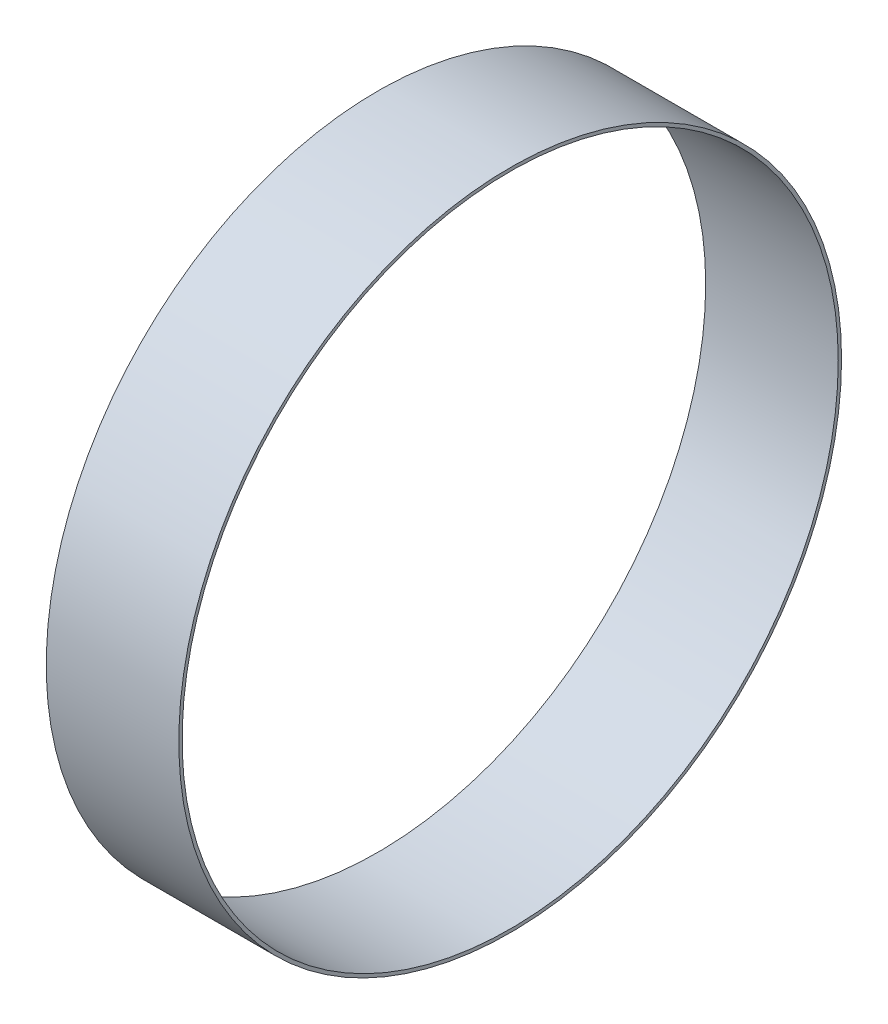
ISO-10303-21;
HEADER;
FILE_DESCRIPTION(('STEP AP214'),'2;1');
FILE_NAME('part.step','',(''),(''),'','','');
FILE_SCHEMA(('AUTOMOTIVE_DESIGN { 1 0 10303 214 1 1 1 1 }'));
ENDSEC;
DATA;
#1=APPLICATION_CONTEXT('core data for automotive mechanical design processes');
#2=APPLICATION_PROTOCOL_DEFINITION('international standard','automotive_design',2000,#1);
#3=PRODUCT_CONTEXT('',#1,'mechanical');
#4=PRODUCT('Part','Part','',(#3));
#5=PRODUCT_RELATED_PRODUCT_CATEGORY('part','',(#4));
#6=PRODUCT_DEFINITION_FORMATION('','',#4);
#7=PRODUCT_DEFINITION_CONTEXT('part definition',#1,'design');
#8=PRODUCT_DEFINITION('design','',#6,#7);
#9=PRODUCT_DEFINITION_SHAPE('','',#8);
#10=(LENGTH_UNIT() NAMED_UNIT(*) SI_UNIT(.MILLI.,.METRE.));
#11=(NAMED_UNIT(*) PLANE_ANGLE_UNIT() SI_UNIT($,.RADIAN.));
#12=(NAMED_UNIT(*) SI_UNIT($,.STERADIAN.) SOLID_ANGLE_UNIT());
#13=UNCERTAINTY_MEASURE_WITH_UNIT(LENGTH_MEASURE(1.E-05),#10,'distance_accuracy_value','');
#14=(GEOMETRIC_REPRESENTATION_CONTEXT(3) GLOBAL_UNCERTAINTY_ASSIGNED_CONTEXT((#13)) GLOBAL_UNIT_ASSIGNED_CONTEXT((#10,
#11,#12)) REPRESENTATION_CONTEXT('',''));
#15=CARTESIAN_POINT('',(0.,0.,0.));
#16=DIRECTION('',(0.,0.,1.));
#17=DIRECTION('',(1.,0.,0.));
#18=AXIS2_PLACEMENT_3D('',#15,#16,#17);
#19=CARTESIAN_POINT('',(20.,0.,0.));
#20=DIRECTION('',(1.,0.,0.));
#21=DIRECTION('',(0.,0.,-1.));
#22=AXIS2_PLACEMENT_3D('',#19,#20,#21);
#23=PLANE('',#22);
#24=CARTESIAN_POINT('',(20.,0.,0.));
#25=DIRECTION('',(1.,0.,0.));
#26=DIRECTION('',(0.,0.,-1.));
#27=AXIS2_PLACEMENT_3D('',#24,#25,#26);
#28=CIRCLE('',#27,50.);
#29=CARTESIAN_POINT('',(20.,0.,-50.));
#30=VERTEX_POINT('',#29);
#31=EDGE_CURVE('E10',#30,#30,#28,.T.);
#32=ORIENTED_EDGE('',*,*,#31,.T.);
#33=EDGE_LOOP('',(#32));
#34=FACE_BOUND('',#33,.T.);
#35=CARTESIAN_POINT('',(20.,0.,0.));
#36=DIRECTION('',(1.,0.,0.));
#37=DIRECTION('',(0.,0.,-1.));
#38=AXIS2_PLACEMENT_3D('',#35,#36,#37);
#39=CIRCLE('',#38,49.5);
#40=CARTESIAN_POINT('',(20.,0.,-49.5));
#41=VERTEX_POINT('',#40);
#42=EDGE_CURVE('E52',#41,#41,#39,.T.);
#43=ORIENTED_EDGE('',*,*,#42,.F.);
#44=EDGE_LOOP('',(#43));
#45=FACE_BOUND('',#44,.T.);
#46=ADVANCED_FACE('F41',(#34,#45),#23,.T.);
#47=CARTESIAN_POINT('',(0.,0.,0.));
#48=DIRECTION('',(1.,0.,0.));
#49=DIRECTION('',(0.,0.,-1.));
#50=AXIS2_PLACEMENT_3D('',#47,#48,#49);
#51=PLANE('',#50);
#52=CARTESIAN_POINT('',(0.,0.,0.));
#53=DIRECTION('',(1.,0.,0.));
#54=DIRECTION('',(0.,0.,-1.));
#55=AXIS2_PLACEMENT_3D('',#52,#53,#54);
#56=CIRCLE('',#55,50.);
#57=CARTESIAN_POINT('',(0.,0.,-50.));
#58=VERTEX_POINT('',#57);
#59=EDGE_CURVE('E45',#58,#58,#56,.T.);
#60=ORIENTED_EDGE('',*,*,#59,.F.);
#61=EDGE_LOOP('',(#60));
#62=FACE_BOUND('',#61,.T.);
#63=CARTESIAN_POINT('',(0.,0.,0.));
#64=DIRECTION('',(1.,0.,0.));
#65=DIRECTION('',(0.,0.,-1.));
#66=AXIS2_PLACEMENT_3D('',#63,#64,#65);
#67=CIRCLE('',#66,49.5);
#68=CARTESIAN_POINT('',(0.,0.,-49.5));
#69=VERTEX_POINT('',#68);
#70=EDGE_CURVE('E54',#69,#69,#67,.T.);
#71=ORIENTED_EDGE('',*,*,#70,.T.);
#72=EDGE_LOOP('',(#71));
#73=FACE_BOUND('',#72,.T.);
#74=ADVANCED_FACE('F64',(#62,#73),#51,.F.);
#75=CARTESIAN_POINT('',(20.,0.,0.));
#76=DIRECTION('',(-1.,0.,0.));
#77=DIRECTION('',(0.,0.,1.));
#78=AXIS2_PLACEMENT_3D('',#75,#76,#77);
#79=CYLINDRICAL_SURFACE('',#78,50.);
#80=ORIENTED_EDGE('',*,*,#31,.F.);
#81=EDGE_LOOP('',(#80));
#82=FACE_BOUND('',#81,.T.);
#83=ORIENTED_EDGE('',*,*,#59,.T.);
#84=EDGE_LOOP('',(#83));
#85=FACE_BOUND('',#84,.T.);
#86=ADVANCED_FACE('F43',(#82,#85),#79,.T.);
#87=CARTESIAN_POINT('',(20.,0.,0.));
#88=DIRECTION('',(-1.,0.,0.));
#89=DIRECTION('',(0.,0.,1.));
#90=AXIS2_PLACEMENT_3D('',#87,#88,#89);
#91=CYLINDRICAL_SURFACE('',#90,49.5);
#92=ORIENTED_EDGE('',*,*,#42,.T.);
#93=EDGE_LOOP('',(#92));
#94=FACE_BOUND('',#93,.T.);
#95=ORIENTED_EDGE('',*,*,#70,.F.);
#96=EDGE_LOOP('',(#95));
#97=FACE_BOUND('',#96,.T.);
#98=ADVANCED_FACE('F60',(#94,#97),#91,.F.);
#99=CLOSED_SHELL('',(#46,#74,#86,#98));
#100=MANIFOLD_SOLID_BREP('B2',#99);
#101=ADVANCED_BREP_SHAPE_REPRESENTATION('',(#18,#100),#14);
#102=SHAPE_DEFINITION_REPRESENTATION(#9,#101);
ENDSEC;
END-ISO-10303-21;
